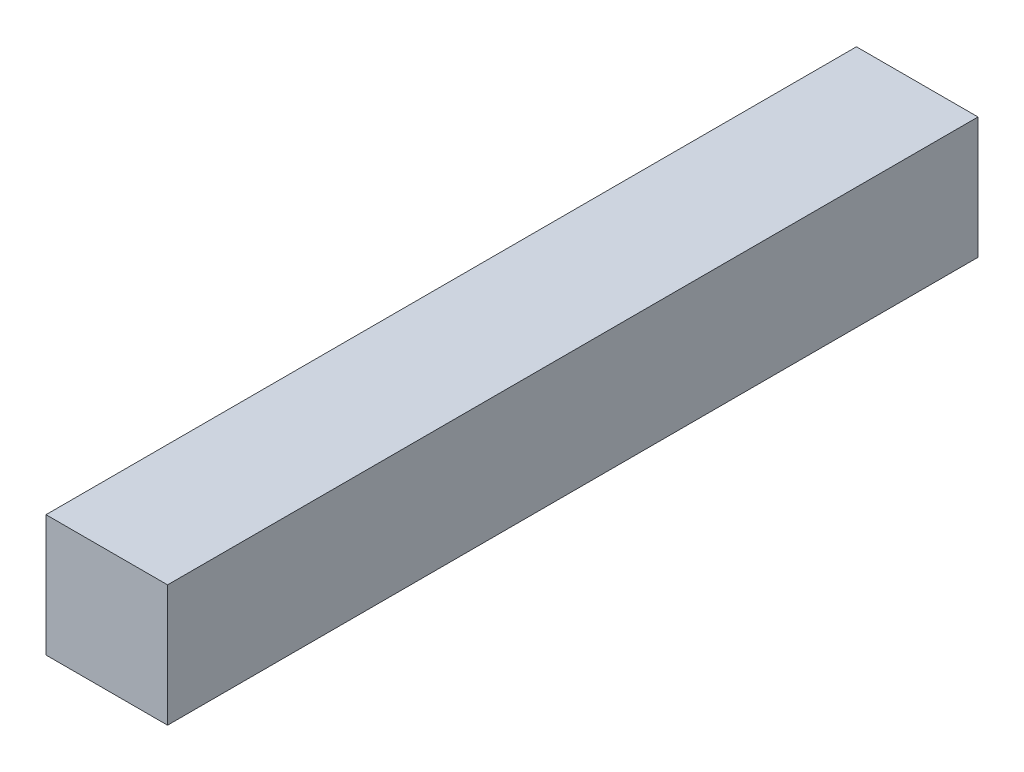
ISO-10303-21;
HEADER;
FILE_DESCRIPTION(('STEP AP214'),'2;1');
FILE_NAME('part.step','',(''),(''),'','','');
FILE_SCHEMA(('AUTOMOTIVE_DESIGN { 1 0 10303 214 1 1 1 1 }'));
ENDSEC;
DATA;
#1=APPLICATION_CONTEXT('core data for automotive mechanical design processes');
#2=APPLICATION_PROTOCOL_DEFINITION('international standard','automotive_design',2000,#1);
#3=PRODUCT_CONTEXT('',#1,'mechanical');
#4=PRODUCT('Part','Part','',(#3));
#5=PRODUCT_RELATED_PRODUCT_CATEGORY('part','',(#4));
#6=PRODUCT_DEFINITION_FORMATION('','',#4);
#7=PRODUCT_DEFINITION_CONTEXT('part definition',#1,'design');
#8=PRODUCT_DEFINITION('design','',#6,#7);
#9=PRODUCT_DEFINITION_SHAPE('','',#8);
#10=(LENGTH_UNIT() NAMED_UNIT(*) SI_UNIT(.MILLI.,.METRE.));
#11=(NAMED_UNIT(*) PLANE_ANGLE_UNIT() SI_UNIT($,.RADIAN.));
#12=(NAMED_UNIT(*) SI_UNIT($,.STERADIAN.) SOLID_ANGLE_UNIT());
#13=UNCERTAINTY_MEASURE_WITH_UNIT(LENGTH_MEASURE(1.E-05),#10,'distance_accuracy_value','');
#14=(GEOMETRIC_REPRESENTATION_CONTEXT(3) GLOBAL_UNCERTAINTY_ASSIGNED_CONTEXT((#13)) GLOBAL_UNIT_ASSIGNED_CONTEXT((#10,
#11,#12)) REPRESENTATION_CONTEXT('',''));
#15=CARTESIAN_POINT('',(0.,0.,0.));
#16=DIRECTION('',(0.,0.,1.));
#17=DIRECTION('',(1.,0.,0.));
#18=AXIS2_PLACEMENT_3D('',#15,#16,#17);
#19=CARTESIAN_POINT('',(0.,0.,300.));
#20=DIRECTION('',(1.,0.,0.));
#21=DIRECTION('',(0.,0.,-1.));
#22=AXIS2_PLACEMENT_3D('',#19,#20,#21);
#23=PLANE('',#22);
#24=DIRECTION('',(0.,-1.,0.));
#25=VECTOR('',#24,1.);
#26=CARTESIAN_POINT('',(0.,0.,0.));
#27=LINE('',#26,#25);
#28=CARTESIAN_POINT('',(0.,45.,0.));
#29=VERTEX_POINT('',#28);
#30=CARTESIAN_POINT('',(0.,0.,0.));
#31=VERTEX_POINT('',#30);
#32=EDGE_CURVE('E107',#29,#31,#27,.T.);
#33=ORIENTED_EDGE('',*,*,#32,.T.);
#34=DIRECTION('',(0.,0.,-1.));
#35=VECTOR('',#34,1.);
#36=CARTESIAN_POINT('',(0.,0.,300.));
#37=LINE('',#36,#35);
#38=CARTESIAN_POINT('',(0.,0.,300.));
#39=VERTEX_POINT('',#38);
#40=EDGE_CURVE('E11',#39,#31,#37,.T.);
#41=ORIENTED_EDGE('',*,*,#40,.F.);
#42=DIRECTION('',(0.,-1.,0.));
#43=VECTOR('',#42,1.);
#44=CARTESIAN_POINT('',(0.,0.,300.));
#45=LINE('',#44,#43);
#46=CARTESIAN_POINT('',(0.,45.,300.));
#47=VERTEX_POINT('',#46);
#48=EDGE_CURVE('E91',#47,#39,#45,.T.);
#49=ORIENTED_EDGE('',*,*,#48,.F.);
#50=DIRECTION('',(0.,0.,-1.));
#51=VECTOR('',#50,1.);
#52=CARTESIAN_POINT('',(0.,45.,300.));
#53=LINE('',#52,#51);
#54=EDGE_CURVE('E103',#47,#29,#53,.T.);
#55=ORIENTED_EDGE('',*,*,#54,.T.);
#56=EDGE_LOOP('',(#33,#41,#49,#55));
#57=FACE_BOUND('',#56,.T.);
#58=ADVANCED_FACE('F39',(#57),#23,.F.);
#59=CARTESIAN_POINT('',(0.,0.,300.));
#60=DIRECTION('',(0.,1.,0.));
#61=DIRECTION('',(0.,0.,1.));
#62=AXIS2_PLACEMENT_3D('',#59,#60,#61);
#63=PLANE('',#62);
#64=DIRECTION('',(1.,0.,0.));
#65=VECTOR('',#64,1.);
#66=CARTESIAN_POINT('',(0.,0.,0.));
#67=LINE('',#66,#65);
#68=CARTESIAN_POINT('',(45.,0.,0.));
#69=VERTEX_POINT('',#68);
#70=EDGE_CURVE('E96',#31,#69,#67,.T.);
#71=ORIENTED_EDGE('',*,*,#70,.T.);
#72=DIRECTION('',(0.,0.,-1.));
#73=VECTOR('',#72,1.);
#74=CARTESIAN_POINT('',(45.,0.,300.));
#75=LINE('',#74,#73);
#76=CARTESIAN_POINT('',(45.,0.,300.));
#77=VERTEX_POINT('',#76);
#78=EDGE_CURVE('E48',#77,#69,#75,.T.);
#79=ORIENTED_EDGE('',*,*,#78,.F.);
#80=DIRECTION('',(1.,0.,0.));
#81=VECTOR('',#80,1.);
#82=CARTESIAN_POINT('',(0.,0.,300.));
#83=LINE('',#82,#81);
#84=EDGE_CURVE('E86',#39,#77,#83,.T.);
#85=ORIENTED_EDGE('',*,*,#84,.F.);
#86=ORIENTED_EDGE('',*,*,#40,.T.);
#87=EDGE_LOOP('',(#71,#79,#85,#86));
#88=FACE_BOUND('',#87,.T.);
#89=ADVANCED_FACE('F95',(#88),#63,.F.);
#90=CARTESIAN_POINT('',(45.,0.,300.));
#91=DIRECTION('',(-1.,0.,0.));
#92=DIRECTION('',(0.,0.,1.));
#93=AXIS2_PLACEMENT_3D('',#90,#91,#92);
#94=PLANE('',#93);
#95=DIRECTION('',(0.,1.,0.));
#96=VECTOR('',#95,1.);
#97=CARTESIAN_POINT('',(45.,0.,0.));
#98=LINE('',#97,#96);
#99=CARTESIAN_POINT('',(45.,45.,0.));
#100=VERTEX_POINT('',#99);
#101=EDGE_CURVE('E73',#69,#100,#98,.T.);
#102=ORIENTED_EDGE('',*,*,#101,.T.);
#103=DIRECTION('',(0.,0.,-1.));
#104=VECTOR('',#103,1.);
#105=CARTESIAN_POINT('',(45.,45.,300.));
#106=LINE('',#105,#104);
#107=CARTESIAN_POINT('',(45.,45.,300.));
#108=VERTEX_POINT('',#107);
#109=EDGE_CURVE('E98',#108,#100,#106,.T.);
#110=ORIENTED_EDGE('',*,*,#109,.F.);
#111=DIRECTION('',(0.,1.,0.));
#112=VECTOR('',#111,1.);
#113=CARTESIAN_POINT('',(45.,0.,300.));
#114=LINE('',#113,#112);
#115=EDGE_CURVE('E89',#77,#108,#114,.T.);
#116=ORIENTED_EDGE('',*,*,#115,.F.);
#117=ORIENTED_EDGE('',*,*,#78,.T.);
#118=EDGE_LOOP('',(#102,#110,#116,#117));
#119=FACE_BOUND('',#118,.T.);
#120=ADVANCED_FACE('F99',(#119),#94,.F.);
#121=CARTESIAN_POINT('',(0.,45.,300.));
#122=DIRECTION('',(0.,-1.,0.));
#123=DIRECTION('',(0.,0.,-1.));
#124=AXIS2_PLACEMENT_3D('',#121,#122,#123);
#125=PLANE('',#124);
#126=DIRECTION('',(-1.,0.,0.));
#127=VECTOR('',#126,1.);
#128=CARTESIAN_POINT('',(0.,45.,0.));
#129=LINE('',#128,#127);
#130=EDGE_CURVE('E79',#100,#29,#129,.T.);
#131=ORIENTED_EDGE('',*,*,#130,.T.);
#132=ORIENTED_EDGE('',*,*,#54,.F.);
#133=DIRECTION('',(-1.,0.,0.));
#134=VECTOR('',#133,1.);
#135=CARTESIAN_POINT('',(0.,45.,300.));
#136=LINE('',#135,#134);
#137=EDGE_CURVE('E56',#108,#47,#136,.T.);
#138=ORIENTED_EDGE('',*,*,#137,.F.);
#139=ORIENTED_EDGE('',*,*,#109,.T.);
#140=EDGE_LOOP('',(#131,#132,#138,#139));
#141=FACE_BOUND('',#140,.T.);
#142=ADVANCED_FACE('F120',(#141),#125,.F.);
#143=CARTESIAN_POINT('',(0.,0.,300.));
#144=DIRECTION('',(0.,0.,-1.));
#145=DIRECTION('',(-1.,0.,0.));
#146=AXIS2_PLACEMENT_3D('',#143,#144,#145);
#147=PLANE('',#146);
#148=ORIENTED_EDGE('',*,*,#48,.T.);
#149=ORIENTED_EDGE('',*,*,#84,.T.);
#150=ORIENTED_EDGE('',*,*,#115,.T.);
#151=ORIENTED_EDGE('',*,*,#137,.T.);
#152=EDGE_LOOP('',(#148,#149,#150,#151));
#153=FACE_BOUND('',#152,.T.);
#154=ADVANCED_FACE('F87',(#153),#147,.F.);
#155=CARTESIAN_POINT('',(0.,0.,0.));
#156=DIRECTION('',(0.,0.,-1.));
#157=DIRECTION('',(-1.,0.,0.));
#158=AXIS2_PLACEMENT_3D('',#155,#156,#157);
#159=PLANE('',#158);
#160=ORIENTED_EDGE('',*,*,#32,.F.);
#161=ORIENTED_EDGE('',*,*,#130,.F.);
#162=ORIENTED_EDGE('',*,*,#101,.F.);
#163=ORIENTED_EDGE('',*,*,#70,.F.);
#164=EDGE_LOOP('',(#160,#161,#162,#163));
#165=FACE_BOUND('',#164,.T.);
#166=ADVANCED_FACE('F123',(#165),#159,.T.);
#167=CLOSED_SHELL('',(#58,#89,#120,#142,#154,#166));
#168=MANIFOLD_SOLID_BREP('B2',#167);
#169=ADVANCED_BREP_SHAPE_REPRESENTATION('',(#18,#168),#14);
#170=SHAPE_DEFINITION_REPRESENTATION(#9,#169);
ENDSEC;
END-ISO-10303-21;
